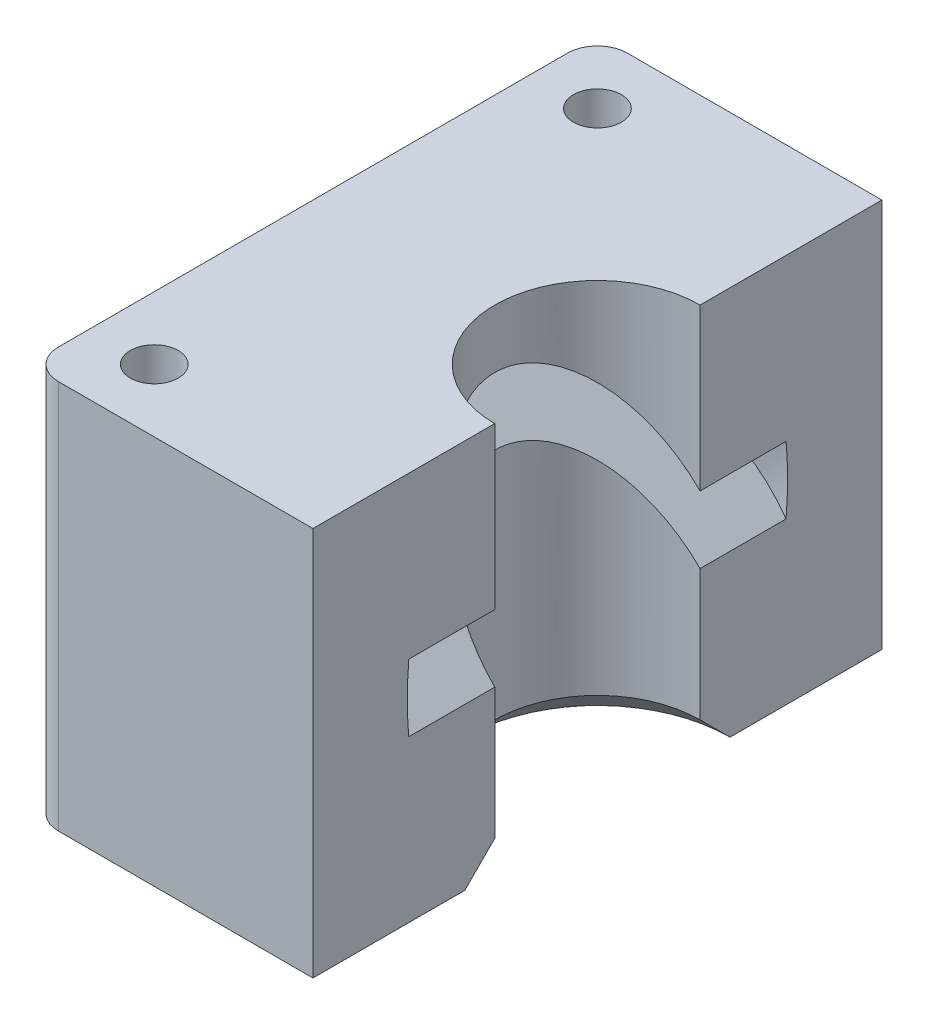
ISO-10303-21;
HEADER;
FILE_DESCRIPTION(('STEP AP214'),'2;1');
FILE_NAME('part.step','',(''),(''),'','','');
FILE_SCHEMA(('AUTOMOTIVE_DESIGN { 1 0 10303 214 1 1 1 1 }'));
ENDSEC;
DATA;
#1=APPLICATION_CONTEXT('core data for automotive mechanical design processes');
#2=APPLICATION_PROTOCOL_DEFINITION('international standard','automotive_design',2000,#1);
#3=PRODUCT_CONTEXT('',#1,'mechanical');
#4=PRODUCT('Part','Part','',(#3));
#5=PRODUCT_RELATED_PRODUCT_CATEGORY('part','',(#4));
#6=PRODUCT_DEFINITION_FORMATION('','',#4);
#7=PRODUCT_DEFINITION_CONTEXT('part definition',#1,'design');
#8=PRODUCT_DEFINITION('design','',#6,#7);
#9=PRODUCT_DEFINITION_SHAPE('','',#8);
#10=(LENGTH_UNIT() NAMED_UNIT(*) SI_UNIT(.MILLI.,.METRE.));
#11=(NAMED_UNIT(*) PLANE_ANGLE_UNIT() SI_UNIT($,.RADIAN.));
#12=(NAMED_UNIT(*) SI_UNIT($,.STERADIAN.) SOLID_ANGLE_UNIT());
#13=UNCERTAINTY_MEASURE_WITH_UNIT(LENGTH_MEASURE(1.E-05),#10,'distance_accuracy_value','');
#14=(GEOMETRIC_REPRESENTATION_CONTEXT(3) GLOBAL_UNCERTAINTY_ASSIGNED_CONTEXT((#13)) GLOBAL_UNIT_ASSIGNED_CONTEXT((#10,
#11,#12)) REPRESENTATION_CONTEXT('',''));
#15=CARTESIAN_POINT('',(0.,0.,0.));
#16=DIRECTION('',(0.,0.,1.));
#17=DIRECTION('',(1.,0.,0.));
#18=AXIS2_PLACEMENT_3D('',#15,#16,#17);
#19=CARTESIAN_POINT('',(0.,0.,0.));
#20=DIRECTION('',(1.,0.,0.));
#21=DIRECTION('',(0.,0.,-1.));
#22=AXIS2_PLACEMENT_3D('',#19,#20,#21);
#23=PLANE('',#22);
#24=DIRECTION('',(0.,0.,-1.));
#25=VECTOR('',#24,1.);
#26=CARTESIAN_POINT('',(0.,32.7450640302673,0.));
#27=LINE('',#26,#25);
#28=CARTESIAN_POINT('',(0.,32.7450640302673,12.6003906189451));
#29=VERTEX_POINT('',#28);
#30=CARTESIAN_POINT('',(0.,32.7450640302673,6.85772410593546));
#31=VERTEX_POINT('',#30);
#32=EDGE_CURVE('E155',#29,#31,#27,.T.);
#33=ORIENTED_EDGE('',*,*,#32,.T.);
#34=DIRECTION('',(0.,1.,0.));
#35=VECTOR('',#34,1.);
#36=CARTESIAN_POINT('',(0.,-1.89657287525367,6.85772410593546));
#37=LINE('',#36,#35);
#38=CARTESIAN_POINT('',(0.,43.5,6.85772410593546));
#39=VERTEX_POINT('',#38);
#40=EDGE_CURVE('E163',#31,#39,#37,.T.);
#41=ORIENTED_EDGE('',*,*,#40,.T.);
#42=DIRECTION('',(0.,0.,-1.));
#43=VECTOR('',#42,1.);
#44=CARTESIAN_POINT('',(0.,43.5,17.));
#45=LINE('',#44,#43);
#46=CARTESIAN_POINT('',(0.,43.5,19.));
#47=VERTEX_POINT('',#46);
#48=EDGE_CURVE('E233',#47,#39,#45,.T.);
#49=ORIENTED_EDGE('',*,*,#48,.F.);
#50=DIRECTION('',(0.,-1.,0.));
#51=VECTOR('',#50,1.);
#52=CARTESIAN_POINT('',(0.,43.5,19.));
#53=LINE('',#52,#51);
#54=CARTESIAN_POINT('',(0.,17.5,19.));
#55=VERTEX_POINT('',#54);
#56=EDGE_CURVE('E230',#47,#55,#53,.T.);
#57=ORIENTED_EDGE('',*,*,#56,.T.);
#58=DIRECTION('',(0.,0.,-1.));
#59=VECTOR('',#58,1.);
#60=CARTESIAN_POINT('',(0.,17.5,17.));
#61=LINE('',#60,#59);
#62=CARTESIAN_POINT('',(0.,17.5,8.85772410593546));
#63=VERTEX_POINT('',#62);
#64=EDGE_CURVE('E226',#55,#63,#61,.T.);
#65=ORIENTED_EDGE('',*,*,#64,.T.);
#66=DIRECTION('',(0.,-0.707106781186547,0.707106781186548));
#67=VECTOR('',#66,1.);
#68=CARTESIAN_POINT('',(0.,26.3577241059354,0.));
#69=LINE('',#68,#67);
#70=CARTESIAN_POINT('',(0.,19.5,6.85772410593546));
#71=VERTEX_POINT('',#70);
#72=EDGE_CURVE('E219',#71,#63,#69,.T.);
#73=ORIENTED_EDGE('',*,*,#72,.F.);
#74=DIRECTION('',(0.,1.,0.));
#75=VECTOR('',#74,1.);
#76=CARTESIAN_POINT('',(0.,-1.89657287525367,6.85772410593546));
#77=LINE('',#76,#75);
#78=CARTESIAN_POINT('',(0.,28.2549359697327,6.85772410593546));
#79=VERTEX_POINT('',#78);
#80=EDGE_CURVE('E207',#71,#79,#77,.T.);
#81=ORIENTED_EDGE('',*,*,#80,.T.);
#82=DIRECTION('',(0.,0.,-1.));
#83=VECTOR('',#82,1.);
#84=CARTESIAN_POINT('',(0.,28.2549359697327,0.));
#85=LINE('',#84,#83);
#86=CARTESIAN_POINT('',(0.,28.2549359697327,12.6003906189451));
#87=VERTEX_POINT('',#86);
#88=EDGE_CURVE('E214',#87,#79,#85,.T.);
#89=ORIENTED_EDGE('',*,*,#88,.F.);
#90=CARTESIAN_POINT('',(0.,30.5,0.));
#91=DIRECTION('',(1.,0.,0.));
#92=DIRECTION('',(0.,1.,0.));
#93=AXIS2_PLACEMENT_3D('',#90,#91,#92);
#94=ELLIPSE('',#93,17.9605122421382,12.7);
#95=EDGE_CURVE('E172',#87,#29,#94,.F.);
#96=ORIENTED_EDGE('',*,*,#95,.T.);
#97=EDGE_LOOP('',(#33,#41,#49,#57,#65,#73,#81,#89,#96));
#98=FACE_BOUND('',#97,.T.);
#99=ADVANCED_FACE('F41',(#98),#23,.T.);
#100=CARTESIAN_POINT('',(0.,43.5,-6.85772410593546));
#101=VERTEX_POINT('',#100);
#102=CARTESIAN_POINT('',(0.,43.5,-19.));
#103=VERTEX_POINT('',#102);
#104=EDGE_CURVE('E216',#101,#103,#45,.T.);
#105=ORIENTED_EDGE('',*,*,#104,.F.);
#106=DIRECTION('',(0.,1.,0.));
#107=VECTOR('',#106,1.);
#108=CARTESIAN_POINT('',(0.,-1.89657287525367,-6.85772410593546));
#109=LINE('',#108,#107);
#110=CARTESIAN_POINT('',(0.,32.7450640302673,-6.85772410593546));
#111=VERTEX_POINT('',#110);
#112=EDGE_CURVE('E167',#101,#111,#109,.F.);
#113=ORIENTED_EDGE('',*,*,#112,.T.);
#114=CARTESIAN_POINT('',(0.,32.7450640302673,-12.6003906189451));
#115=VERTEX_POINT('',#114);
#116=EDGE_CURVE('E157',#111,#115,#27,.T.);
#117=ORIENTED_EDGE('',*,*,#116,.T.);
#118=CARTESIAN_POINT('',(0.,28.2549359697327,-12.6003906189451));
#119=VERTEX_POINT('',#118);
#120=EDGE_CURVE('E174',#115,#119,#94,.F.);
#121=ORIENTED_EDGE('',*,*,#120,.T.);
#122=CARTESIAN_POINT('',(0.,28.2549359697327,-6.85772410593546));
#123=VERTEX_POINT('',#122);
#124=EDGE_CURVE('E212',#123,#119,#85,.T.);
#125=ORIENTED_EDGE('',*,*,#124,.F.);
#126=DIRECTION('',(0.,1.,0.));
#127=VECTOR('',#126,1.);
#128=CARTESIAN_POINT('',(0.,-1.89657287525367,-6.85772410593546));
#129=LINE('',#128,#127);
#130=CARTESIAN_POINT('',(0.,19.5,-6.85772410593546));
#131=VERTEX_POINT('',#130);
#132=EDGE_CURVE('E168',#123,#131,#129,.F.);
#133=ORIENTED_EDGE('',*,*,#132,.T.);
#134=DIRECTION('',(0.,0.707106781186547,0.707106781186548));
#135=VECTOR('',#134,1.);
#136=CARTESIAN_POINT('',(0.,26.3577241059354,0.));
#137=LINE('',#136,#135);
#138=CARTESIAN_POINT('',(0.,17.5,-8.85772410593546));
#139=VERTEX_POINT('',#138);
#140=EDGE_CURVE('E182',#139,#131,#137,.T.);
#141=ORIENTED_EDGE('',*,*,#140,.F.);
#142=CARTESIAN_POINT('',(0.,17.5,-19.));
#143=VERTEX_POINT('',#142);
#144=EDGE_CURVE('E223',#139,#143,#61,.T.);
#145=ORIENTED_EDGE('',*,*,#144,.T.);
#146=DIRECTION('',(0.,1.,0.));
#147=VECTOR('',#146,1.);
#148=CARTESIAN_POINT('',(0.,43.5,-19.));
#149=LINE('',#148,#147);
#150=EDGE_CURVE('E227',#143,#103,#149,.T.);
#151=ORIENTED_EDGE('',*,*,#150,.T.);
#152=EDGE_LOOP('',(#105,#113,#117,#121,#125,#133,#141,#145,#151));
#153=FACE_BOUND('',#152,.T.);
#154=ADVANCED_FACE('F284',(#153),#23,.T.);
#155=CARTESIAN_POINT('',(17.,43.5,-19.));
#156=DIRECTION('',(0.,0.,1.));
#157=DIRECTION('',(1.,0.,0.));
#158=AXIS2_PLACEMENT_3D('',#155,#156,#157);
#159=PLANE('',#158);
#160=ORIENTED_EDGE('',*,*,#150,.F.);
#161=DIRECTION('',(-1.,0.,0.));
#162=VECTOR('',#161,1.);
#163=CARTESIAN_POINT('',(17.,17.5,-19.));
#164=LINE('',#163,#162);
#165=CARTESIAN_POINT('',(-17.,17.5,-19.));
#166=VERTEX_POINT('',#165);
#167=EDGE_CURVE('E190',#143,#166,#164,.T.);
#168=ORIENTED_EDGE('',*,*,#167,.T.);
#169=DIRECTION('',(0.,-1.,0.));
#170=VECTOR('',#169,1.);
#171=CARTESIAN_POINT('',(-17.,43.5,-19.));
#172=LINE('',#171,#170);
#173=CARTESIAN_POINT('',(-17.,43.5,-19.));
#174=VERTEX_POINT('',#173);
#175=EDGE_CURVE('E255',#174,#166,#172,.T.);
#176=ORIENTED_EDGE('',*,*,#175,.F.);
#177=DIRECTION('',(-1.,0.,0.));
#178=VECTOR('',#177,1.);
#179=CARTESIAN_POINT('',(17.,43.5,-19.));
#180=LINE('',#179,#178);
#181=EDGE_CURVE('E79',#103,#174,#180,.T.);
#182=ORIENTED_EDGE('',*,*,#181,.F.);
#183=EDGE_LOOP('',(#160,#168,#176,#182));
#184=FACE_BOUND('',#183,.T.);
#185=ADVANCED_FACE('F281',(#184),#159,.F.);
#186=CARTESIAN_POINT('',(-17.,43.5,-17.));
#187=DIRECTION('',(0.,-1.,0.));
#188=DIRECTION('',(0.,0.,-1.));
#189=AXIS2_PLACEMENT_3D('',#186,#187,#188);
#190=CYLINDRICAL_SURFACE('',#189,2.);
#191=CARTESIAN_POINT('',(-17.,17.5,-17.));
#192=DIRECTION('',(0.,1.,0.));
#193=DIRECTION('',(0.,0.,1.));
#194=AXIS2_PLACEMENT_3D('',#191,#192,#193);
#195=CIRCLE('',#194,2.);
#196=CARTESIAN_POINT('',(-19.,17.5,-17.));
#197=VERTEX_POINT('',#196);
#198=EDGE_CURVE('E192',#166,#197,#195,.T.);
#199=ORIENTED_EDGE('',*,*,#198,.T.);
#200=DIRECTION('',(0.,-1.,0.));
#201=VECTOR('',#200,1.);
#202=CARTESIAN_POINT('',(-19.,43.5,-17.));
#203=LINE('',#202,#201);
#204=CARTESIAN_POINT('',(-19.,43.5,-17.));
#205=VERTEX_POINT('',#204);
#206=EDGE_CURVE('E253',#205,#197,#203,.T.);
#207=ORIENTED_EDGE('',*,*,#206,.F.);
#208=CARTESIAN_POINT('',(-17.,43.5,-17.));
#209=DIRECTION('',(0.,1.,0.));
#210=DIRECTION('',(0.,0.,1.));
#211=AXIS2_PLACEMENT_3D('',#208,#209,#210);
#212=CIRCLE('',#211,2.);
#213=EDGE_CURVE('E187',#174,#205,#212,.T.);
#214=ORIENTED_EDGE('',*,*,#213,.F.);
#215=ORIENTED_EDGE('',*,*,#175,.T.);
#216=EDGE_LOOP('',(#199,#207,#214,#215));
#217=FACE_BOUND('',#216,.T.);
#218=ADVANCED_FACE('F283',(#217),#190,.T.);
#219=CARTESIAN_POINT('',(-19.,43.5,-17.));
#220=DIRECTION('',(1.,0.,0.));
#221=DIRECTION('',(0.,0.,-1.));
#222=AXIS2_PLACEMENT_3D('',#219,#220,#221);
#223=PLANE('',#222);
#224=DIRECTION('',(0.,0.,1.));
#225=VECTOR('',#224,1.);
#226=CARTESIAN_POINT('',(-19.,17.5,-17.));
#227=LINE('',#226,#225);
#228=CARTESIAN_POINT('',(-19.,17.5,17.));
#229=VERTEX_POINT('',#228);
#230=EDGE_CURVE('E94',#197,#229,#227,.T.);
#231=ORIENTED_EDGE('',*,*,#230,.T.);
#232=DIRECTION('',(0.,-1.,0.));
#233=VECTOR('',#232,1.);
#234=CARTESIAN_POINT('',(-19.,43.5,17.));
#235=LINE('',#234,#233);
#236=CARTESIAN_POINT('',(-19.,43.5,17.));
#237=VERTEX_POINT('',#236);
#238=EDGE_CURVE('E247',#237,#229,#235,.T.);
#239=ORIENTED_EDGE('',*,*,#238,.F.);
#240=DIRECTION('',(0.,0.,1.));
#241=VECTOR('',#240,1.);
#242=CARTESIAN_POINT('',(-19.,43.5,-17.));
#243=LINE('',#242,#241);
#244=EDGE_CURVE('E245',#205,#237,#243,.T.);
#245=ORIENTED_EDGE('',*,*,#244,.F.);
#246=ORIENTED_EDGE('',*,*,#206,.T.);
#247=EDGE_LOOP('',(#231,#239,#245,#246));
#248=FACE_BOUND('',#247,.T.);
#249=ADVANCED_FACE('F292',(#248),#223,.F.);
#250=CARTESIAN_POINT('',(-17.,43.5,17.));
#251=DIRECTION('',(0.,-1.,0.));
#252=DIRECTION('',(0.,0.,-1.));
#253=AXIS2_PLACEMENT_3D('',#250,#251,#252);
#254=CYLINDRICAL_SURFACE('',#253,2.);
#255=CARTESIAN_POINT('',(-17.,17.5,17.));
#256=DIRECTION('',(0.,1.,0.));
#257=DIRECTION('',(0.,0.,1.));
#258=AXIS2_PLACEMENT_3D('',#255,#256,#257);
#259=CIRCLE('',#258,2.);
#260=CARTESIAN_POINT('',(-17.,17.5,19.));
#261=VERTEX_POINT('',#260);
#262=EDGE_CURVE('E194',#229,#261,#259,.T.);
#263=ORIENTED_EDGE('',*,*,#262,.T.);
#264=DIRECTION('',(0.,-1.,0.));
#265=VECTOR('',#264,1.);
#266=CARTESIAN_POINT('',(-17.,43.5,19.));
#267=LINE('',#266,#265);
#268=CARTESIAN_POINT('',(-17.,43.5,19.));
#269=VERTEX_POINT('',#268);
#270=EDGE_CURVE('E185',#269,#261,#267,.T.);
#271=ORIENTED_EDGE('',*,*,#270,.F.);
#272=CARTESIAN_POINT('',(-17.,43.5,17.));
#273=DIRECTION('',(0.,1.,0.));
#274=DIRECTION('',(0.,0.,1.));
#275=AXIS2_PLACEMENT_3D('',#272,#273,#274);
#276=CIRCLE('',#275,2.);
#277=EDGE_CURVE('E189',#237,#269,#276,.T.);
#278=ORIENTED_EDGE('',*,*,#277,.F.);
#279=ORIENTED_EDGE('',*,*,#238,.T.);
#280=EDGE_LOOP('',(#263,#271,#278,#279));
#281=FACE_BOUND('',#280,.T.);
#282=ADVANCED_FACE('F278',(#281),#254,.T.);
#283=CARTESIAN_POINT('',(-17.,43.5,19.));
#284=DIRECTION('',(0.,0.,-1.));
#285=DIRECTION('',(-1.,0.,0.));
#286=AXIS2_PLACEMENT_3D('',#283,#284,#285);
#287=PLANE('',#286);
#288=ORIENTED_EDGE('',*,*,#56,.F.);
#289=DIRECTION('',(1.,0.,0.));
#290=VECTOR('',#289,1.);
#291=CARTESIAN_POINT('',(-17.,43.5,19.));
#292=LINE('',#291,#290);
#293=EDGE_CURVE('E86',#269,#47,#292,.T.);
#294=ORIENTED_EDGE('',*,*,#293,.F.);
#295=ORIENTED_EDGE('',*,*,#270,.T.);
#296=DIRECTION('',(1.,0.,0.));
#297=VECTOR('',#296,1.);
#298=CARTESIAN_POINT('',(-17.,17.5,19.));
#299=LINE('',#298,#297);
#300=EDGE_CURVE('E61',#261,#55,#299,.T.);
#301=ORIENTED_EDGE('',*,*,#300,.T.);
#302=EDGE_LOOP('',(#288,#294,#295,#301));
#303=FACE_BOUND('',#302,.T.);
#304=ADVANCED_FACE('F267',(#303),#287,.F.);
#305=CARTESIAN_POINT('',(-14.8,88.5,14.8));
#306=DIRECTION('',(0.,-1.,0.));
#307=DIRECTION('',(0.,0.,-1.));
#308=AXIS2_PLACEMENT_3D('',#305,#306,#307);
#309=CYLINDRICAL_SURFACE('',#308,1.6);
#310=CARTESIAN_POINT('',(-14.8,43.5,14.8));
#311=DIRECTION('',(0.,1.,0.));
#312=DIRECTION('',(0.,0.,1.));
#313=AXIS2_PLACEMENT_3D('',#310,#311,#312);
#314=CIRCLE('',#313,1.6);
#315=CARTESIAN_POINT('',(-14.8,43.5,16.4));
#316=VERTEX_POINT('',#315);
#317=EDGE_CURVE('E240',#316,#316,#314,.T.);
#318=ORIENTED_EDGE('',*,*,#317,.T.);
#319=EDGE_LOOP('',(#318));
#320=FACE_BOUND('',#319,.T.);
#321=CARTESIAN_POINT('',(-14.8,17.5,14.8));
#322=DIRECTION('',(0.,1.,0.));
#323=DIRECTION('',(0.,0.,1.));
#324=AXIS2_PLACEMENT_3D('',#321,#322,#323);
#325=CIRCLE('',#324,1.6);
#326=CARTESIAN_POINT('',(-14.8,17.5,16.4));
#327=VERTEX_POINT('',#326);
#328=EDGE_CURVE('E239',#327,#327,#325,.T.);
#329=ORIENTED_EDGE('',*,*,#328,.F.);
#330=EDGE_LOOP('',(#329));
#331=FACE_BOUND('',#330,.T.);
#332=ADVANCED_FACE('F264',(#320,#331),#309,.F.);
#333=CARTESIAN_POINT('',(-14.8,88.5,-14.8));
#334=DIRECTION('',(0.,-1.,0.));
#335=DIRECTION('',(0.,0.,-1.));
#336=AXIS2_PLACEMENT_3D('',#333,#334,#335);
#337=CYLINDRICAL_SURFACE('',#336,1.6);
#338=CARTESIAN_POINT('',(-14.8,43.5,-14.8));
#339=DIRECTION('',(0.,1.,0.));
#340=DIRECTION('',(0.,0.,1.));
#341=AXIS2_PLACEMENT_3D('',#338,#339,#340);
#342=CIRCLE('',#341,1.6);
#343=CARTESIAN_POINT('',(-14.8,43.5,-13.2));
#344=VERTEX_POINT('',#343);
#345=EDGE_CURVE('E52',#344,#344,#342,.T.);
#346=ORIENTED_EDGE('',*,*,#345,.T.);
#347=EDGE_LOOP('',(#346));
#348=FACE_BOUND('',#347,.T.);
#349=CARTESIAN_POINT('',(-14.8,17.5,-14.8));
#350=DIRECTION('',(0.,1.,0.));
#351=DIRECTION('',(0.,0.,1.));
#352=AXIS2_PLACEMENT_3D('',#349,#350,#351);
#353=CIRCLE('',#352,1.6);
#354=CARTESIAN_POINT('',(-14.8,17.5,-13.2));
#355=VERTEX_POINT('',#354);
#356=EDGE_CURVE('E11',#355,#355,#353,.T.);
#357=ORIENTED_EDGE('',*,*,#356,.F.);
#358=EDGE_LOOP('',(#357));
#359=FACE_BOUND('',#358,.T.);
#360=ADVANCED_FACE('F266',(#348,#359),#337,.F.);
#361=CARTESIAN_POINT('',(-17.,43.5,17.));
#362=DIRECTION('',(0.,1.,0.));
#363=DIRECTION('',(0.,0.,1.));
#364=AXIS2_PLACEMENT_3D('',#361,#362,#363);
#365=PLANE('',#364);
#366=ORIENTED_EDGE('',*,*,#345,.F.);
#367=EDGE_LOOP('',(#366));
#368=FACE_BOUND('',#367,.T.);
#369=ORIENTED_EDGE('',*,*,#317,.F.);
#370=EDGE_LOOP('',(#369));
#371=FACE_BOUND('',#370,.T.);
#372=ORIENTED_EDGE('',*,*,#293,.T.);
#373=ORIENTED_EDGE('',*,*,#48,.T.);
#374=CARTESIAN_POINT('',(0.,43.5,0.));
#375=DIRECTION('',(0.,1.,0.));
#376=DIRECTION('',(0.,0.,1.));
#377=AXIS2_PLACEMENT_3D('',#374,#375,#376);
#378=CIRCLE('',#377,6.85772410593546);
#379=EDGE_CURVE('E46',#101,#39,#378,.T.);
#380=ORIENTED_EDGE('',*,*,#379,.F.);
#381=ORIENTED_EDGE('',*,*,#104,.T.);
#382=ORIENTED_EDGE('',*,*,#181,.T.);
#383=ORIENTED_EDGE('',*,*,#213,.T.);
#384=ORIENTED_EDGE('',*,*,#244,.T.);
#385=ORIENTED_EDGE('',*,*,#277,.T.);
#386=EDGE_LOOP('',(#372,#373,#380,#381,#382,#383,#384,#385));
#387=FACE_BOUND('',#386,.T.);
#388=ADVANCED_FACE('F275',(#368,#371,#387),#365,.T.);
#389=CARTESIAN_POINT('',(-17.,17.5,17.));
#390=DIRECTION('',(0.,1.,0.));
#391=DIRECTION('',(0.,0.,1.));
#392=AXIS2_PLACEMENT_3D('',#389,#390,#391);
#393=PLANE('',#392);
#394=ORIENTED_EDGE('',*,*,#356,.T.);
#395=EDGE_LOOP('',(#394));
#396=FACE_BOUND('',#395,.T.);
#397=ORIENTED_EDGE('',*,*,#328,.T.);
#398=EDGE_LOOP('',(#397));
#399=FACE_BOUND('',#398,.T.);
#400=ORIENTED_EDGE('',*,*,#64,.F.);
#401=ORIENTED_EDGE('',*,*,#300,.F.);
#402=ORIENTED_EDGE('',*,*,#262,.F.);
#403=ORIENTED_EDGE('',*,*,#230,.F.);
#404=ORIENTED_EDGE('',*,*,#198,.F.);
#405=ORIENTED_EDGE('',*,*,#167,.F.);
#406=ORIENTED_EDGE('',*,*,#144,.F.);
#407=CARTESIAN_POINT('',(0.,17.5,0.));
#408=DIRECTION('',(0.,1.,0.));
#409=DIRECTION('',(0.,0.,1.));
#410=AXIS2_PLACEMENT_3D('',#407,#408,#409);
#411=CIRCLE('',#410,8.85772410593546);
#412=EDGE_CURVE('E178',#139,#63,#411,.T.);
#413=ORIENTED_EDGE('',*,*,#412,.T.);
#414=EDGE_LOOP('',(#400,#401,#402,#403,#404,#405,#406,#413));
#415=FACE_BOUND('',#414,.T.);
#416=ADVANCED_FACE('F262',(#396,#399,#415),#393,.F.);
#417=CARTESIAN_POINT('',(0.,-1.89657287525367,0.));
#418=DIRECTION('',(0.,1.,0.));
#419=DIRECTION('',(0.,0.,1.));
#420=AXIS2_PLACEMENT_3D('',#417,#418,#419);
#421=CYLINDRICAL_SURFACE('',#420,6.85772410593546);
#422=ORIENTED_EDGE('',*,*,#132,.F.);
#423=CARTESIAN_POINT('',(0.,28.2549359697327,0.));
#424=DIRECTION('',(0.707106781186551,0.707106781186544,0.));
#425=DIRECTION('',(-0.707106781186544,0.707106781186551,0.));
#426=AXIS2_PLACEMENT_3D('',#423,#424,#425);
#427=ELLIPSE('',#426,9.69828643762689,6.85772410593546);
#428=EDGE_CURVE('E161',#123,#79,#427,.T.);
#429=ORIENTED_EDGE('',*,*,#428,.T.);
#430=ORIENTED_EDGE('',*,*,#80,.F.);
#431=CARTESIAN_POINT('',(0.,19.5,0.));
#432=DIRECTION('',(0.,1.,0.));
#433=DIRECTION('',(0.,0.,1.));
#434=AXIS2_PLACEMENT_3D('',#431,#432,#433);
#435=CIRCLE('',#434,6.85772410593546);
#436=EDGE_CURVE('E181',#71,#131,#435,.F.);
#437=ORIENTED_EDGE('',*,*,#436,.T.);
#438=EDGE_LOOP('',(#422,#429,#430,#437));
#439=FACE_BOUND('',#438,.T.);
#440=ADVANCED_FACE('F205',(#439),#421,.F.);
#441=CARTESIAN_POINT('',(0.,19.5,0.));
#442=DIRECTION('',(0.,-1.,0.));
#443=DIRECTION('',(0.,0.,-1.));
#444=AXIS2_PLACEMENT_3D('',#441,#442,#443);
#445=CONICAL_SURFACE('',#444,6.85772410593546,0.785398163397449);
#446=ORIENTED_EDGE('',*,*,#436,.F.);
#447=ORIENTED_EDGE('',*,*,#72,.T.);
#448=ORIENTED_EDGE('',*,*,#412,.F.);
#449=ORIENTED_EDGE('',*,*,#140,.T.);
#450=EDGE_LOOP('',(#446,#447,#448,#449));
#451=FACE_BOUND('',#450,.T.);
#452=ADVANCED_FACE('F44',(#451),#445,.F.);
#453=ORIENTED_EDGE('',*,*,#112,.F.);
#454=ORIENTED_EDGE('',*,*,#379,.T.);
#455=ORIENTED_EDGE('',*,*,#40,.F.);
#456=CARTESIAN_POINT('',(0.,32.7450640302673,0.));
#457=DIRECTION('',(0.707106781186551,0.707106781186544,0.));
#458=DIRECTION('',(-0.707106781186544,0.707106781186551,0.));
#459=AXIS2_PLACEMENT_3D('',#456,#457,#458);
#460=ELLIPSE('',#459,9.69828643762689,6.85772410593546);
#461=EDGE_CURVE('E151',#111,#31,#460,.T.);
#462=ORIENTED_EDGE('',*,*,#461,.F.);
#463=EDGE_LOOP('',(#453,#454,#455,#462));
#464=FACE_BOUND('',#463,.T.);
#465=ADVANCED_FACE('F164',(#464),#421,.F.);
#466=CARTESIAN_POINT('',(-1.12253201513363,29.3774679848664,0.));
#467=DIRECTION('',(0.707106781186551,0.707106781186544,0.));
#468=DIRECTION('',(-0.707106781186544,0.707106781186551,0.));
#469=AXIS2_PLACEMENT_3D('',#466,#467,#468);
#470=CYLINDRICAL_SURFACE('',#469,12.7);
#471=ORIENTED_EDGE('',*,*,#120,.F.);
#472=CARTESIAN_POINT('',(1.12253201513367,31.6225320151337,0.));
#473=DIRECTION('',(0.707106781186551,0.707106781186544,0.));
#474=DIRECTION('',(-0.707106781186544,0.707106781186551,0.));
#475=AXIS2_PLACEMENT_3D('',#472,#473,#474);
#476=CIRCLE('',#475,12.7);
#477=EDGE_CURVE('E198',#115,#29,#476,.T.);
#478=ORIENTED_EDGE('',*,*,#477,.T.);
#479=ORIENTED_EDGE('',*,*,#95,.F.);
#480=CARTESIAN_POINT('',(-1.12253201513363,29.3774679848664,0.));
#481=DIRECTION('',(0.707106781186551,0.707106781186544,0.));
#482=DIRECTION('',(-0.707106781186544,0.707106781186551,0.));
#483=AXIS2_PLACEMENT_3D('',#480,#481,#482);
#484=CIRCLE('',#483,12.7);
#485=EDGE_CURVE('E195',#119,#87,#484,.T.);
#486=ORIENTED_EDGE('',*,*,#485,.F.);
#487=EDGE_LOOP('',(#471,#478,#479,#486));
#488=FACE_BOUND('',#487,.T.);
#489=ADVANCED_FACE('F306',(#488),#470,.F.);
#490=CARTESIAN_POINT('',(1.12253201513367,31.6225320151337,0.));
#491=DIRECTION('',(0.707106781186551,0.707106781186544,0.));
#492=DIRECTION('',(-0.707106781186544,0.707106781186551,0.));
#493=AXIS2_PLACEMENT_3D('',#490,#491,#492);
#494=PLANE('',#493);
#495=ORIENTED_EDGE('',*,*,#32,.F.);
#496=ORIENTED_EDGE('',*,*,#477,.F.);
#497=ORIENTED_EDGE('',*,*,#116,.F.);
#498=ORIENTED_EDGE('',*,*,#461,.T.);
#499=EDGE_LOOP('',(#495,#496,#497,#498));
#500=FACE_BOUND('',#499,.T.);
#501=ADVANCED_FACE('F153',(#500),#494,.F.);
#502=CARTESIAN_POINT('',(-1.12253201513363,29.3774679848664,0.));
#503=DIRECTION('',(0.707106781186551,0.707106781186544,0.));
#504=DIRECTION('',(-0.707106781186544,0.707106781186551,0.));
#505=AXIS2_PLACEMENT_3D('',#502,#503,#504);
#506=PLANE('',#505);
#507=ORIENTED_EDGE('',*,*,#485,.T.);
#508=ORIENTED_EDGE('',*,*,#88,.T.);
#509=ORIENTED_EDGE('',*,*,#428,.F.);
#510=ORIENTED_EDGE('',*,*,#124,.T.);
#511=EDGE_LOOP('',(#507,#508,#509,#510));
#512=FACE_BOUND('',#511,.T.);
#513=ADVANCED_FACE('F211',(#512),#506,.T.);
#514=CLOSED_SHELL('',(#99,#154,#185,#218,#249,#282,#304,#332,#360,#388,#416,#440,#452,#465,#489,
#501,#513));
#515=MANIFOLD_SOLID_BREP('B2',#514);
#516=ADVANCED_BREP_SHAPE_REPRESENTATION('',(#18,#515),#14);
#517=SHAPE_DEFINITION_REPRESENTATION(#9,#516);
ENDSEC;
END-ISO-10303-21;
